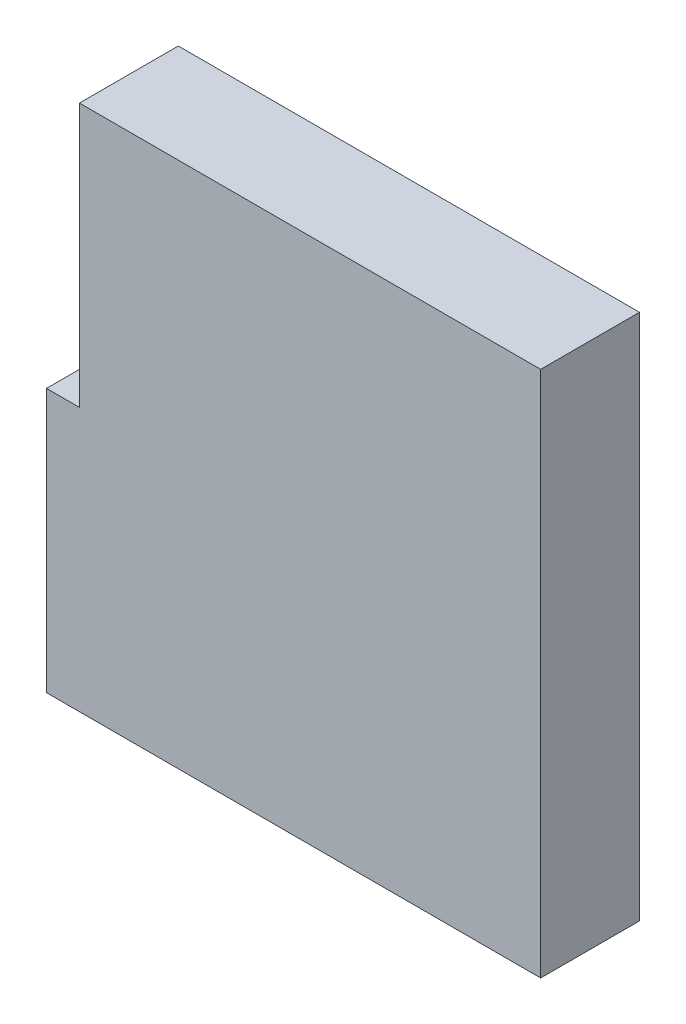
ISO-10303-21;
HEADER;
FILE_DESCRIPTION(('STEP AP214'),'2;1');
FILE_NAME('part.step','',(''),(''),'','','');
FILE_SCHEMA(('AUTOMOTIVE_DESIGN { 1 0 10303 214 1 1 1 1 }'));
ENDSEC;
DATA;
#1=APPLICATION_CONTEXT('core data for automotive mechanical design processes');
#2=APPLICATION_PROTOCOL_DEFINITION('international standard','automotive_design',2000,#1);
#3=PRODUCT_CONTEXT('',#1,'mechanical');
#4=PRODUCT('Part','Part','',(#3));
#5=PRODUCT_RELATED_PRODUCT_CATEGORY('part','',(#4));
#6=PRODUCT_DEFINITION_FORMATION('','',#4);
#7=PRODUCT_DEFINITION_CONTEXT('part definition',#1,'design');
#8=PRODUCT_DEFINITION('design','',#6,#7);
#9=PRODUCT_DEFINITION_SHAPE('','',#8);
#10=(LENGTH_UNIT() NAMED_UNIT(*) SI_UNIT(.MILLI.,.METRE.));
#11=(NAMED_UNIT(*) PLANE_ANGLE_UNIT() SI_UNIT($,.RADIAN.));
#12=(NAMED_UNIT(*) SI_UNIT($,.STERADIAN.) SOLID_ANGLE_UNIT());
#13=UNCERTAINTY_MEASURE_WITH_UNIT(LENGTH_MEASURE(1.E-05),#10,'distance_accuracy_value','');
#14=(GEOMETRIC_REPRESENTATION_CONTEXT(3) GLOBAL_UNCERTAINTY_ASSIGNED_CONTEXT((#13)) GLOBAL_UNIT_ASSIGNED_CONTEXT((#10,
#11,#12)) REPRESENTATION_CONTEXT('',''));
#15=CARTESIAN_POINT('',(0.,0.,0.));
#16=DIRECTION('',(0.,0.,1.));
#17=DIRECTION('',(1.,0.,0.));
#18=AXIS2_PLACEMENT_3D('',#15,#16,#17);
#19=CARTESIAN_POINT('',(0.,203.2,38.1));
#20=DIRECTION('',(0.,-1.,0.));
#21=DIRECTION('',(1.,0.,0.));
#22=AXIS2_PLACEMENT_3D('',#19,#20,#21);
#23=PLANE('',#22);
#24=DIRECTION('',(-1.,0.,0.));
#25=VECTOR('',#24,1.);
#26=CARTESIAN_POINT('',(0.,203.2,0.));
#27=LINE('',#26,#25);
#28=CARTESIAN_POINT('',(0.,203.2,0.));
#29=VERTEX_POINT('',#28);
#30=CARTESIAN_POINT('',(-177.8,203.2,0.));
#31=VERTEX_POINT('',#30);
#32=EDGE_CURVE('E117',#29,#31,#27,.T.);
#33=ORIENTED_EDGE('',*,*,#32,.T.);
#34=DIRECTION('',(0.,0.,-1.));
#35=VECTOR('',#34,1.);
#36=CARTESIAN_POINT('',(-177.8,203.2,38.1));
#37=LINE('',#36,#35);
#38=CARTESIAN_POINT('',(-177.8,203.2,38.1));
#39=VERTEX_POINT('',#38);
#40=EDGE_CURVE('E11',#39,#31,#37,.T.);
#41=ORIENTED_EDGE('',*,*,#40,.F.);
#42=DIRECTION('',(-1.,0.,0.));
#43=VECTOR('',#42,1.);
#44=CARTESIAN_POINT('',(0.,203.2,38.1));
#45=LINE('',#44,#43);
#46=CARTESIAN_POINT('',(0.,203.2,38.1));
#47=VERTEX_POINT('',#46);
#48=EDGE_CURVE('E127',#47,#39,#45,.T.);
#49=ORIENTED_EDGE('',*,*,#48,.F.);
#50=DIRECTION('',(0.,0.,-1.));
#51=VECTOR('',#50,1.);
#52=CARTESIAN_POINT('',(0.,203.2,38.1));
#53=LINE('',#52,#51);
#54=EDGE_CURVE('E113',#47,#29,#53,.T.);
#55=ORIENTED_EDGE('',*,*,#54,.T.);
#56=EDGE_LOOP('',(#33,#41,#49,#55));
#57=FACE_BOUND('',#56,.T.);
#58=ADVANCED_FACE('F33',(#57),#23,.F.);
#59=CARTESIAN_POINT('',(-177.8,203.2,38.1));
#60=DIRECTION('',(1.,0.,0.));
#61=DIRECTION('',(0.,1.,0.));
#62=AXIS2_PLACEMENT_3D('',#59,#60,#61);
#63=PLANE('',#62);
#64=DIRECTION('',(0.,-1.,0.));
#65=VECTOR('',#64,1.);
#66=CARTESIAN_POINT('',(-177.8,203.2,0.));
#67=LINE('',#66,#65);
#68=CARTESIAN_POINT('',(-177.8,101.6,0.));
#69=VERTEX_POINT('',#68);
#70=EDGE_CURVE('E120',#31,#69,#67,.T.);
#71=ORIENTED_EDGE('',*,*,#70,.T.);
#72=DIRECTION('',(0.,0.,-1.));
#73=VECTOR('',#72,1.);
#74=CARTESIAN_POINT('',(-177.8,101.6,38.1));
#75=LINE('',#74,#73);
#76=CARTESIAN_POINT('',(-177.8,101.6,38.1));
#77=VERTEX_POINT('',#76);
#78=EDGE_CURVE('E41',#77,#69,#75,.T.);
#79=ORIENTED_EDGE('',*,*,#78,.F.);
#80=DIRECTION('',(0.,-1.,0.));
#81=VECTOR('',#80,1.);
#82=CARTESIAN_POINT('',(-177.8,203.2,38.1));
#83=LINE('',#82,#81);
#84=EDGE_CURVE('E86',#39,#77,#83,.T.);
#85=ORIENTED_EDGE('',*,*,#84,.F.);
#86=ORIENTED_EDGE('',*,*,#40,.T.);
#87=EDGE_LOOP('',(#71,#79,#85,#86));
#88=FACE_BOUND('',#87,.T.);
#89=ADVANCED_FACE('F151',(#88),#63,.F.);
#90=CARTESIAN_POINT('',(-177.8,101.6,38.1));
#91=DIRECTION('',(0.,-1.,0.));
#92=DIRECTION('',(1.,0.,0.));
#93=AXIS2_PLACEMENT_3D('',#90,#91,#92);
#94=PLANE('',#93);
#95=DIRECTION('',(-1.,0.,0.));
#96=VECTOR('',#95,1.);
#97=CARTESIAN_POINT('',(-177.8,101.6,0.));
#98=LINE('',#97,#96);
#99=CARTESIAN_POINT('',(-190.5,101.6,0.));
#100=VERTEX_POINT('',#99);
#101=EDGE_CURVE('E122',#69,#100,#98,.T.);
#102=ORIENTED_EDGE('',*,*,#101,.T.);
#103=DIRECTION('',(0.,0.,-1.));
#104=VECTOR('',#103,1.);
#105=CARTESIAN_POINT('',(-190.5,101.6,38.1));
#106=LINE('',#105,#104);
#107=CARTESIAN_POINT('',(-190.5,101.6,38.1));
#108=VERTEX_POINT('',#107);
#109=EDGE_CURVE('E108',#108,#100,#106,.T.);
#110=ORIENTED_EDGE('',*,*,#109,.F.);
#111=DIRECTION('',(-1.,0.,0.));
#112=VECTOR('',#111,1.);
#113=CARTESIAN_POINT('',(-177.8,101.6,38.1));
#114=LINE('',#113,#112);
#115=EDGE_CURVE('E99',#77,#108,#114,.T.);
#116=ORIENTED_EDGE('',*,*,#115,.F.);
#117=ORIENTED_EDGE('',*,*,#78,.T.);
#118=EDGE_LOOP('',(#102,#110,#116,#117));
#119=FACE_BOUND('',#118,.T.);
#120=ADVANCED_FACE('F133',(#119),#94,.F.);
#121=CARTESIAN_POINT('',(-190.5,101.6,38.1));
#122=DIRECTION('',(1.,0.,0.));
#123=DIRECTION('',(0.,1.,0.));
#124=AXIS2_PLACEMENT_3D('',#121,#122,#123);
#125=PLANE('',#124);
#126=DIRECTION('',(0.,-1.,0.));
#127=VECTOR('',#126,1.);
#128=CARTESIAN_POINT('',(-190.5,101.6,0.));
#129=LINE('',#128,#127);
#130=CARTESIAN_POINT('',(-190.5,0.,0.));
#131=VERTEX_POINT('',#130);
#132=EDGE_CURVE('E107',#100,#131,#129,.T.);
#133=ORIENTED_EDGE('',*,*,#132,.T.);
#134=DIRECTION('',(0.,0.,-1.));
#135=VECTOR('',#134,1.);
#136=CARTESIAN_POINT('',(-190.5,0.,38.1));
#137=LINE('',#136,#135);
#138=CARTESIAN_POINT('',(-190.5,0.,38.1));
#139=VERTEX_POINT('',#138);
#140=EDGE_CURVE('E104',#139,#131,#137,.T.);
#141=ORIENTED_EDGE('',*,*,#140,.F.);
#142=DIRECTION('',(0.,-1.,0.));
#143=VECTOR('',#142,1.);
#144=CARTESIAN_POINT('',(-190.5,101.6,38.1));
#145=LINE('',#144,#143);
#146=EDGE_CURVE('E93',#108,#139,#145,.T.);
#147=ORIENTED_EDGE('',*,*,#146,.F.);
#148=ORIENTED_EDGE('',*,*,#109,.T.);
#149=EDGE_LOOP('',(#133,#141,#147,#148));
#150=FACE_BOUND('',#149,.T.);
#151=ADVANCED_FACE('F105',(#150),#125,.F.);
#152=CARTESIAN_POINT('',(-190.5,0.,38.1));
#153=DIRECTION('',(0.,1.,0.));
#154=DIRECTION('',(0.,0.,1.));
#155=AXIS2_PLACEMENT_3D('',#152,#153,#154);
#156=PLANE('',#155);
#157=DIRECTION('',(1.,0.,0.));
#158=VECTOR('',#157,1.);
#159=CARTESIAN_POINT('',(-190.5,0.,0.));
#160=LINE('',#159,#158);
#161=CARTESIAN_POINT('',(0.,0.,0.));
#162=VERTEX_POINT('',#161);
#163=EDGE_CURVE('E72',#131,#162,#160,.T.);
#164=ORIENTED_EDGE('',*,*,#163,.T.);
#165=DIRECTION('',(0.,0.,-1.));
#166=VECTOR('',#165,1.);
#167=CARTESIAN_POINT('',(0.,0.,38.1));
#168=LINE('',#167,#166);
#169=CARTESIAN_POINT('',(0.,0.,38.1));
#170=VERTEX_POINT('',#169);
#171=EDGE_CURVE('E109',#170,#162,#168,.T.);
#172=ORIENTED_EDGE('',*,*,#171,.F.);
#173=DIRECTION('',(1.,0.,0.));
#174=VECTOR('',#173,1.);
#175=CARTESIAN_POINT('',(-190.5,0.,38.1));
#176=LINE('',#175,#174);
#177=EDGE_CURVE('E97',#139,#170,#176,.T.);
#178=ORIENTED_EDGE('',*,*,#177,.F.);
#179=ORIENTED_EDGE('',*,*,#140,.T.);
#180=EDGE_LOOP('',(#164,#172,#178,#179));
#181=FACE_BOUND('',#180,.T.);
#182=ADVANCED_FACE('F111',(#181),#156,.F.);
#183=CARTESIAN_POINT('',(0.,0.,38.1));
#184=DIRECTION('',(-1.,0.,0.));
#185=DIRECTION('',(0.,0.,1.));
#186=AXIS2_PLACEMENT_3D('',#183,#184,#185);
#187=PLANE('',#186);
#188=DIRECTION('',(0.,1.,0.));
#189=VECTOR('',#188,1.);
#190=CARTESIAN_POINT('',(0.,0.,0.));
#191=LINE('',#190,#189);
#192=EDGE_CURVE('E78',#162,#29,#191,.T.);
#193=ORIENTED_EDGE('',*,*,#192,.T.);
#194=ORIENTED_EDGE('',*,*,#54,.F.);
#195=DIRECTION('',(0.,1.,0.));
#196=VECTOR('',#195,1.);
#197=CARTESIAN_POINT('',(0.,0.,38.1));
#198=LINE('',#197,#196);
#199=EDGE_CURVE('E49',#170,#47,#198,.T.);
#200=ORIENTED_EDGE('',*,*,#199,.F.);
#201=ORIENTED_EDGE('',*,*,#171,.T.);
#202=EDGE_LOOP('',(#193,#194,#200,#201));
#203=FACE_BOUND('',#202,.T.);
#204=ADVANCED_FACE('F140',(#203),#187,.F.);
#205=CARTESIAN_POINT('',(0.,0.,38.1));
#206=DIRECTION('',(0.,0.,1.));
#207=DIRECTION('',(1.,0.,0.));
#208=AXIS2_PLACEMENT_3D('',#205,#206,#207);
#209=PLANE('',#208);
#210=ORIENTED_EDGE('',*,*,#48,.T.);
#211=ORIENTED_EDGE('',*,*,#84,.T.);
#212=ORIENTED_EDGE('',*,*,#115,.T.);
#213=ORIENTED_EDGE('',*,*,#146,.T.);
#214=ORIENTED_EDGE('',*,*,#177,.T.);
#215=ORIENTED_EDGE('',*,*,#199,.T.);
#216=EDGE_LOOP('',(#210,#211,#212,#213,#214,#215));
#217=FACE_BOUND('',#216,.T.);
#218=ADVANCED_FACE('F95',(#217),#209,.T.);
#219=CARTESIAN_POINT('',(0.,0.,0.));
#220=DIRECTION('',(0.,0.,1.));
#221=DIRECTION('',(1.,0.,0.));
#222=AXIS2_PLACEMENT_3D('',#219,#220,#221);
#223=PLANE('',#222);
#224=ORIENTED_EDGE('',*,*,#32,.F.);
#225=ORIENTED_EDGE('',*,*,#192,.F.);
#226=ORIENTED_EDGE('',*,*,#163,.F.);
#227=ORIENTED_EDGE('',*,*,#132,.F.);
#228=ORIENTED_EDGE('',*,*,#101,.F.);
#229=ORIENTED_EDGE('',*,*,#70,.F.);
#230=EDGE_LOOP('',(#224,#225,#226,#227,#228,#229));
#231=FACE_BOUND('',#230,.T.);
#232=ADVANCED_FACE('F136',(#231),#223,.F.);
#233=CLOSED_SHELL('',(#58,#89,#120,#151,#182,#204,#218,#232));
#234=MANIFOLD_SOLID_BREP('B2',#233);
#235=ADVANCED_BREP_SHAPE_REPRESENTATION('',(#18,#234),#14);
#236=SHAPE_DEFINITION_REPRESENTATION(#9,#235);
ENDSEC;
END-ISO-10303-21;
